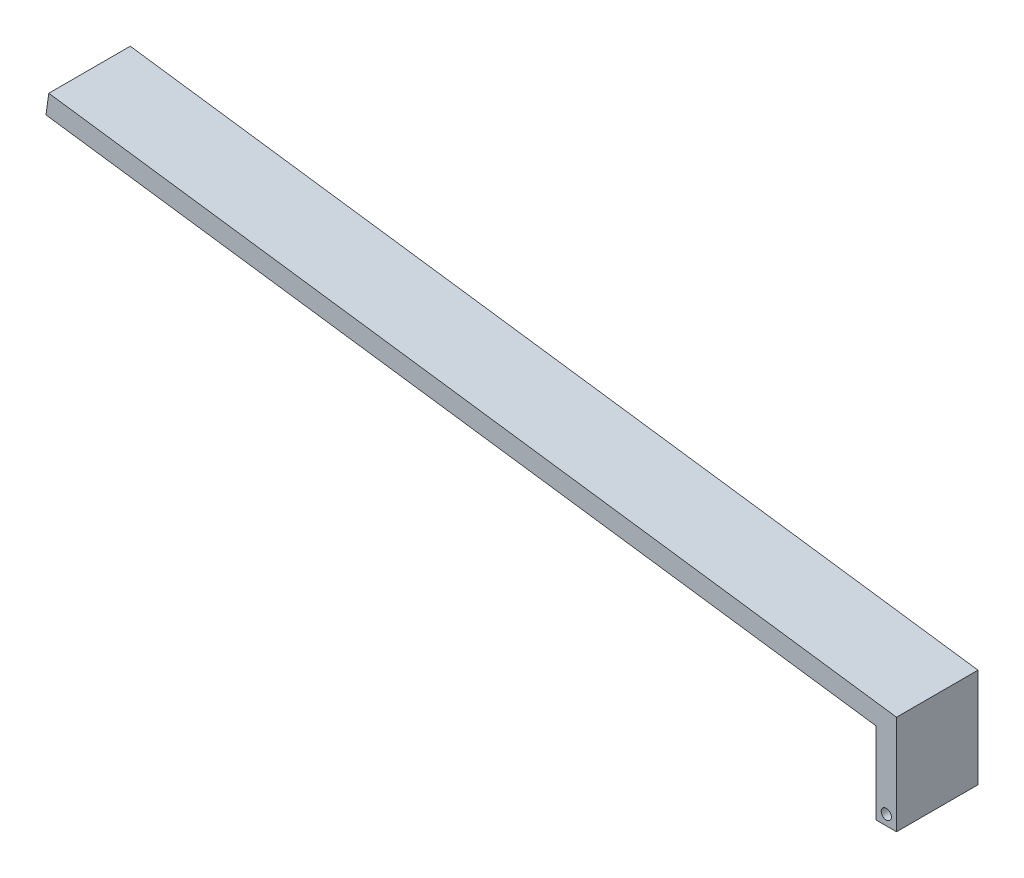
ISO-10303-21;
HEADER;
FILE_DESCRIPTION(('STEP AP214'),'2;1');
FILE_NAME('part.step','',(''),(''),'','','');
FILE_SCHEMA(('AUTOMOTIVE_DESIGN { 1 0 10303 214 1 1 1 1 }'));
ENDSEC;
DATA;
#1=APPLICATION_CONTEXT('core data for automotive mechanical design processes');
#2=APPLICATION_PROTOCOL_DEFINITION('international standard','automotive_design',2000,#1);
#3=PRODUCT_CONTEXT('',#1,'mechanical');
#4=PRODUCT('Part','Part','',(#3));
#5=PRODUCT_RELATED_PRODUCT_CATEGORY('part','',(#4));
#6=PRODUCT_DEFINITION_FORMATION('','',#4);
#7=PRODUCT_DEFINITION_CONTEXT('part definition',#1,'design');
#8=PRODUCT_DEFINITION('design','',#6,#7);
#9=PRODUCT_DEFINITION_SHAPE('','',#8);
#10=(LENGTH_UNIT() NAMED_UNIT(*) SI_UNIT(.MILLI.,.METRE.));
#11=(NAMED_UNIT(*) PLANE_ANGLE_UNIT() SI_UNIT($,.RADIAN.));
#12=(NAMED_UNIT(*) SI_UNIT($,.STERADIAN.) SOLID_ANGLE_UNIT());
#13=UNCERTAINTY_MEASURE_WITH_UNIT(LENGTH_MEASURE(1.E-05),#10,'distance_accuracy_value','');
#14=(GEOMETRIC_REPRESENTATION_CONTEXT(3) GLOBAL_UNCERTAINTY_ASSIGNED_CONTEXT((#13)) GLOBAL_UNIT_ASSIGNED_CONTEXT((#10,
#11,#12)) REPRESENTATION_CONTEXT('',''));
#15=CARTESIAN_POINT('',(0.,0.,0.));
#16=DIRECTION('',(0.,0.,1.));
#17=DIRECTION('',(1.,0.,0.));
#18=AXIS2_PLACEMENT_3D('',#15,#16,#17);
#19=CARTESIAN_POINT('',(17.1043919804639,-1.32079917880462,4.));
#20=DIRECTION('',(1.,0.,0.));
#21=DIRECTION('',(0.,0.,-1.));
#22=AXIS2_PLACEMENT_3D('',#19,#20,#21);
#23=PLANE('',#22);
#24=DIRECTION('',(0.,-1.,0.));
#25=VECTOR('',#24,1.);
#26=CARTESIAN_POINT('',(17.1043919804639,-1.32079917880462,0.));
#27=LINE('',#26,#25);
#28=CARTESIAN_POINT('',(17.1043919804639,-1.32079917880462,0.));
#29=VERTEX_POINT('',#28);
#30=CARTESIAN_POINT('',(17.1043919804639,-5.32079917880462,0.));
#31=VERTEX_POINT('',#30);
#32=EDGE_CURVE('E116',#29,#31,#27,.T.);
#33=ORIENTED_EDGE('',*,*,#32,.T.);
#34=DIRECTION('',(0.,0.,-1.));
#35=VECTOR('',#34,1.);
#36=CARTESIAN_POINT('',(17.1043919804639,-5.32079917880462,4.));
#37=LINE('',#36,#35);
#38=CARTESIAN_POINT('',(17.1043919804639,-5.32079917880462,4.));
#39=VERTEX_POINT('',#38);
#40=EDGE_CURVE('E11',#39,#31,#37,.T.);
#41=ORIENTED_EDGE('',*,*,#40,.F.);
#42=DIRECTION('',(0.,-1.,0.));
#43=VECTOR('',#42,1.);
#44=CARTESIAN_POINT('',(17.1043919804639,-1.32079917880462,4.));
#45=LINE('',#44,#43);
#46=CARTESIAN_POINT('',(17.1043919804639,-1.32079917880462,4.));
#47=VERTEX_POINT('',#46);
#48=EDGE_CURVE('E126',#47,#39,#45,.T.);
#49=ORIENTED_EDGE('',*,*,#48,.F.);
#50=DIRECTION('',(0.,0.,-1.));
#51=VECTOR('',#50,1.);
#52=CARTESIAN_POINT('',(17.1043919804639,-1.32079917880462,4.));
#53=LINE('',#52,#51);
#54=EDGE_CURVE('E112',#47,#29,#53,.T.);
#55=ORIENTED_EDGE('',*,*,#54,.T.);
#56=EDGE_LOOP('',(#33,#41,#49,#55));
#57=FACE_BOUND('',#56,.T.);
#58=ADVANCED_FACE('F31',(#57),#23,.F.);
#59=CARTESIAN_POINT('',(17.1043919804639,-5.32079917880462,4.));
#60=DIRECTION('',(0.,1.,0.));
#61=DIRECTION('',(0.,0.,1.));
#62=AXIS2_PLACEMENT_3D('',#59,#60,#61);
#63=PLANE('',#62);
#64=DIRECTION('',(1.,0.,0.));
#65=VECTOR('',#64,1.);
#66=CARTESIAN_POINT('',(17.1043919804639,-5.32079917880462,0.));
#67=LINE('',#66,#65);
#68=CARTESIAN_POINT('',(18.1043919804639,-5.32079917880462,0.));
#69=VERTEX_POINT('',#68);
#70=EDGE_CURVE('E119',#31,#69,#67,.T.);
#71=ORIENTED_EDGE('',*,*,#70,.T.);
#72=DIRECTION('',(0.,0.,-1.));
#73=VECTOR('',#72,1.);
#74=CARTESIAN_POINT('',(18.1043919804639,-5.32079917880462,4.));
#75=LINE('',#74,#73);
#76=CARTESIAN_POINT('',(18.1043919804639,-5.32079917880462,4.));
#77=VERTEX_POINT('',#76);
#78=EDGE_CURVE('E40',#77,#69,#75,.T.);
#79=ORIENTED_EDGE('',*,*,#78,.F.);
#80=DIRECTION('',(1.,0.,0.));
#81=VECTOR('',#80,1.);
#82=CARTESIAN_POINT('',(17.1043919804639,-5.32079917880462,4.));
#83=LINE('',#82,#81);
#84=EDGE_CURVE('E85',#39,#77,#83,.T.);
#85=ORIENTED_EDGE('',*,*,#84,.F.);
#86=ORIENTED_EDGE('',*,*,#40,.T.);
#87=EDGE_LOOP('',(#71,#79,#85,#86));
#88=FACE_BOUND('',#87,.T.);
#89=ADVANCED_FACE('F152',(#88),#63,.F.);
#90=CARTESIAN_POINT('',(18.1043919804639,-5.32079917880462,4.));
#91=DIRECTION('',(-1.,0.,0.));
#92=DIRECTION('',(0.,0.,1.));
#93=AXIS2_PLACEMENT_3D('',#90,#91,#92);
#94=PLANE('',#93);
#95=DIRECTION('',(0.,1.,0.));
#96=VECTOR('',#95,1.);
#97=CARTESIAN_POINT('',(18.1043919804639,-5.32079917880462,0.));
#98=LINE('',#97,#96);
#99=CARTESIAN_POINT('',(18.1043919804639,-0.448838619571443,0.));
#100=VERTEX_POINT('',#99);
#101=EDGE_CURVE('E121',#69,#100,#98,.T.);
#102=ORIENTED_EDGE('',*,*,#101,.T.);
#103=DIRECTION('',(0.,0.,-1.));
#104=VECTOR('',#103,1.);
#105=CARTESIAN_POINT('',(18.1043919804639,-0.448838619571443,4.));
#106=LINE('',#105,#104);
#107=CARTESIAN_POINT('',(18.1043919804639,-0.448838619571443,4.));
#108=VERTEX_POINT('',#107);
#109=EDGE_CURVE('E107',#108,#100,#106,.T.);
#110=ORIENTED_EDGE('',*,*,#109,.F.);
#111=DIRECTION('',(0.,1.,0.));
#112=VECTOR('',#111,1.);
#113=CARTESIAN_POINT('',(18.1043919804639,-5.32079917880462,4.));
#114=LINE('',#113,#112);
#115=EDGE_CURVE('E98',#77,#108,#114,.T.);
#116=ORIENTED_EDGE('',*,*,#115,.F.);
#117=ORIENTED_EDGE('',*,*,#78,.T.);
#118=EDGE_LOOP('',(#102,#110,#116,#117));
#119=FACE_BOUND('',#118,.T.);
#120=ADVANCED_FACE('F133',(#119),#94,.F.);
#121=CARTESIAN_POINT('',(18.1043919804639,-0.448838619571443,4.));
#122=DIRECTION('',(-0.136160149526826,-0.990686839359862,0.));
#123=DIRECTION('',(0.990686839359862,-0.136160149526826,0.));
#124=AXIS2_PLACEMENT_3D('',#121,#122,#123);
#125=PLANE('',#124);
#126=DIRECTION('',(-0.990686839359862,0.136160149526826,0.));
#127=VECTOR('',#126,1.);
#128=CARTESIAN_POINT('',(18.1043919804639,-0.448838619571443,0.));
#129=LINE('',#128,#127);
#130=CARTESIAN_POINT('',(-23.5044552726503,5.26988766055524,0.));
#131=VERTEX_POINT('',#130);
#132=EDGE_CURVE('E106',#100,#131,#129,.T.);
#133=ORIENTED_EDGE('',*,*,#132,.T.);
#134=DIRECTION('',(0.,0.,-1.));
#135=VECTOR('',#134,1.);
#136=CARTESIAN_POINT('',(-23.5044552726503,5.26988766055524,4.));
#137=LINE('',#136,#135);
#138=CARTESIAN_POINT('',(-23.5044552726503,5.26988766055524,4.));
#139=VERTEX_POINT('',#138);
#140=EDGE_CURVE('E103',#139,#131,#137,.T.);
#141=ORIENTED_EDGE('',*,*,#140,.F.);
#142=DIRECTION('',(-0.990686839359862,0.136160149526826,0.));
#143=VECTOR('',#142,1.);
#144=CARTESIAN_POINT('',(18.1043919804639,-0.448838619571443,4.));
#145=LINE('',#144,#143);
#146=EDGE_CURVE('E92',#108,#139,#145,.T.);
#147=ORIENTED_EDGE('',*,*,#146,.F.);
#148=ORIENTED_EDGE('',*,*,#109,.T.);
#149=EDGE_LOOP('',(#133,#141,#147,#148));
#150=FACE_BOUND('',#149,.T.);
#151=ADVANCED_FACE('F104',(#150),#125,.F.);
#152=CARTESIAN_POINT('',(-23.5044552726503,5.26988766055524,4.));
#153=DIRECTION('',(0.990686839359861,-0.136160149526828,0.));
#154=DIRECTION('',(0.136160149526828,0.990686839359862,0.));
#155=AXIS2_PLACEMENT_3D('',#152,#153,#154);
#156=PLANE('',#155);
#157=DIRECTION('',(-0.136160149526828,-0.990686839359861,0.));
#158=VECTOR('',#157,1.);
#159=CARTESIAN_POINT('',(-23.5044552726503,5.26988766055524,0.));
#160=LINE('',#159,#158);
#161=CARTESIAN_POINT('',(-23.6406154221771,4.27920082119538,0.));
#162=VERTEX_POINT('',#161);
#163=EDGE_CURVE('E71',#131,#162,#160,.T.);
#164=ORIENTED_EDGE('',*,*,#163,.T.);
#165=DIRECTION('',(0.,0.,-1.));
#166=VECTOR('',#165,1.);
#167=CARTESIAN_POINT('',(-23.6406154221771,4.27920082119538,4.));
#168=LINE('',#167,#166);
#169=CARTESIAN_POINT('',(-23.6406154221771,4.27920082119538,4.));
#170=VERTEX_POINT('',#169);
#171=EDGE_CURVE('E108',#170,#162,#168,.T.);
#172=ORIENTED_EDGE('',*,*,#171,.F.);
#173=DIRECTION('',(-0.136160149526828,-0.990686839359861,0.));
#174=VECTOR('',#173,1.);
#175=CARTESIAN_POINT('',(-23.5044552726503,5.26988766055524,4.));
#176=LINE('',#175,#174);
#177=EDGE_CURVE('E96',#139,#170,#176,.T.);
#178=ORIENTED_EDGE('',*,*,#177,.F.);
#179=ORIENTED_EDGE('',*,*,#140,.T.);
#180=EDGE_LOOP('',(#164,#172,#178,#179));
#181=FACE_BOUND('',#180,.T.);
#182=ADVANCED_FACE('F110',(#181),#156,.F.);
#183=CARTESIAN_POINT('',(-23.6406154221771,4.27920082119538,4.));
#184=DIRECTION('',(0.136160149526826,0.990686839359862,0.));
#185=DIRECTION('',(-0.990686839359862,0.136160149526826,0.));
#186=AXIS2_PLACEMENT_3D('',#183,#184,#185);
#187=PLANE('',#186);
#188=DIRECTION('',(0.990686839359862,-0.136160149526826,0.));
#189=VECTOR('',#188,1.);
#190=CARTESIAN_POINT('',(-23.6406154221771,4.27920082119538,0.));
#191=LINE('',#190,#189);
#192=EDGE_CURVE('E77',#162,#29,#191,.T.);
#193=ORIENTED_EDGE('',*,*,#192,.T.);
#194=ORIENTED_EDGE('',*,*,#54,.F.);
#195=DIRECTION('',(0.990686839359862,-0.136160149526826,0.));
#196=VECTOR('',#195,1.);
#197=CARTESIAN_POINT('',(-23.6406154221771,4.27920082119538,4.));
#198=LINE('',#197,#196);
#199=EDGE_CURVE('E48',#170,#47,#198,.T.);
#200=ORIENTED_EDGE('',*,*,#199,.F.);
#201=ORIENTED_EDGE('',*,*,#171,.T.);
#202=EDGE_LOOP('',(#193,#194,#200,#201));
#203=FACE_BOUND('',#202,.T.);
#204=ADVANCED_FACE('F140',(#203),#187,.F.);
#205=CARTESIAN_POINT('',(17.1043919804639,-5.32079917880462,4.));
#206=DIRECTION('',(0.,0.,1.));
#207=DIRECTION('',(1.,0.,0.));
#208=AXIS2_PLACEMENT_3D('',#205,#206,#207);
#209=PLANE('',#208);
#210=CARTESIAN_POINT('',(17.6043919804639,-4.82079917880462,4.));
#211=DIRECTION('',(0.,0.,1.));
#212=DIRECTION('',(1.,0.,0.));
#213=AXIS2_PLACEMENT_3D('',#210,#211,#212);
#214=CIRCLE('',#213,0.25);
#215=CARTESIAN_POINT('',(17.8543919804639,-4.82079917880462,4.));
#216=VERTEX_POINT('',#215);
#217=EDGE_CURVE('E205',#216,#216,#214,.T.);
#218=ORIENTED_EDGE('',*,*,#217,.F.);
#219=EDGE_LOOP('',(#218));
#220=FACE_BOUND('',#219,.T.);
#221=ORIENTED_EDGE('',*,*,#48,.T.);
#222=ORIENTED_EDGE('',*,*,#84,.T.);
#223=ORIENTED_EDGE('',*,*,#115,.T.);
#224=ORIENTED_EDGE('',*,*,#146,.T.);
#225=ORIENTED_EDGE('',*,*,#177,.T.);
#226=ORIENTED_EDGE('',*,*,#199,.T.);
#227=EDGE_LOOP('',(#221,#222,#223,#224,#225,#226));
#228=FACE_BOUND('',#227,.T.);
#229=ADVANCED_FACE('F94',(#220,#228),#209,.T.);
#230=CARTESIAN_POINT('',(17.1043919804639,-5.32079917880462,0.));
#231=DIRECTION('',(0.,0.,1.));
#232=DIRECTION('',(1.,0.,0.));
#233=AXIS2_PLACEMENT_3D('',#230,#231,#232);
#234=PLANE('',#233);
#235=CARTESIAN_POINT('',(17.6043919804639,-4.82079917880462,0.));
#236=DIRECTION('',(0.,0.,1.));
#237=DIRECTION('',(1.,0.,0.));
#238=AXIS2_PLACEMENT_3D('',#235,#236,#237);
#239=CIRCLE('',#238,0.25);
#240=CARTESIAN_POINT('',(17.8543919804639,-4.82079917880462,0.));
#241=VERTEX_POINT('',#240);
#242=EDGE_CURVE('E34',#241,#241,#239,.T.);
#243=ORIENTED_EDGE('',*,*,#242,.T.);
#244=EDGE_LOOP('',(#243));
#245=FACE_BOUND('',#244,.T.);
#246=ORIENTED_EDGE('',*,*,#32,.F.);
#247=ORIENTED_EDGE('',*,*,#192,.F.);
#248=ORIENTED_EDGE('',*,*,#163,.F.);
#249=ORIENTED_EDGE('',*,*,#132,.F.);
#250=ORIENTED_EDGE('',*,*,#101,.F.);
#251=ORIENTED_EDGE('',*,*,#70,.F.);
#252=EDGE_LOOP('',(#246,#247,#248,#249,#250,#251));
#253=FACE_BOUND('',#252,.T.);
#254=ADVANCED_FACE('F136',(#245,#253),#234,.F.);
#255=CARTESIAN_POINT('',(17.6043919804639,-4.82079917880462,-10.));
#256=DIRECTION('',(0.,0.,1.));
#257=DIRECTION('',(1.,0.,0.));
#258=AXIS2_PLACEMENT_3D('',#255,#256,#257);
#259=CYLINDRICAL_SURFACE('',#258,0.25);
#260=ORIENTED_EDGE('',*,*,#217,.T.);
#261=EDGE_LOOP('',(#260));
#262=FACE_BOUND('',#261,.T.);
#263=ORIENTED_EDGE('',*,*,#242,.F.);
#264=EDGE_LOOP('',(#263));
#265=FACE_BOUND('',#264,.T.);
#266=ADVANCED_FACE('F189',(#262,#265),#259,.F.);
#267=CLOSED_SHELL('',(#58,#89,#120,#151,#182,#204,#229,#254,#266));
#268=MANIFOLD_SOLID_BREP('B2',#267);
#269=ADVANCED_BREP_SHAPE_REPRESENTATION('',(#18,#268),#14);
#270=SHAPE_DEFINITION_REPRESENTATION(#9,#269);
ENDSEC;
END-ISO-10303-21;
